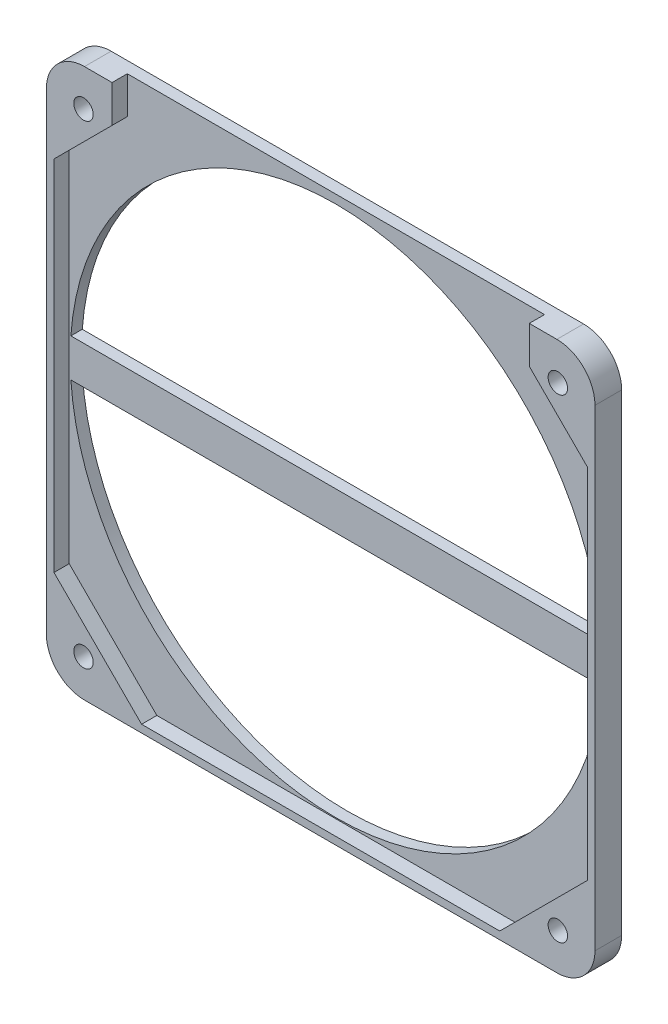
ISO-10303-21;
HEADER;
FILE_DESCRIPTION(('STEP AP214'),'2;1');
FILE_NAME('part.step','',(''),(''),'','','');
FILE_SCHEMA(('AUTOMOTIVE_DESIGN { 1 0 10303 214 1 1 1 1 }'));
ENDSEC;
DATA;
#1=APPLICATION_CONTEXT('core data for automotive mechanical design processes');
#2=APPLICATION_PROTOCOL_DEFINITION('international standard','automotive_design',2000,#1);
#3=PRODUCT_CONTEXT('',#1,'mechanical');
#4=PRODUCT('Part','Part','',(#3));
#5=PRODUCT_RELATED_PRODUCT_CATEGORY('part','',(#4));
#6=PRODUCT_DEFINITION_FORMATION('','',#4);
#7=PRODUCT_DEFINITION_CONTEXT('part definition',#1,'design');
#8=PRODUCT_DEFINITION('design','',#6,#7);
#9=PRODUCT_DEFINITION_SHAPE('','',#8);
#10=(LENGTH_UNIT() NAMED_UNIT(*) SI_UNIT(.MILLI.,.METRE.));
#11=(NAMED_UNIT(*) PLANE_ANGLE_UNIT() SI_UNIT($,.RADIAN.));
#12=(NAMED_UNIT(*) SI_UNIT($,.STERADIAN.) SOLID_ANGLE_UNIT());
#13=UNCERTAINTY_MEASURE_WITH_UNIT(LENGTH_MEASURE(1.E-05),#10,'distance_accuracy_value','');
#14=(GEOMETRIC_REPRESENTATION_CONTEXT(3) GLOBAL_UNCERTAINTY_ASSIGNED_CONTEXT((#13)) GLOBAL_UNIT_ASSIGNED_CONTEXT((#10,
#11,#12)) REPRESENTATION_CONTEXT('',''));
#15=CARTESIAN_POINT('',(0.,0.,0.));
#16=DIRECTION('',(0.,0.,1.));
#17=DIRECTION('',(1.,0.,0.));
#18=AXIS2_PLACEMENT_3D('',#15,#16,#17);
#19=CARTESIAN_POINT('',(0.,0.,0.));
#20=DIRECTION('',(0.,0.,1.));
#21=DIRECTION('',(1.,0.,0.));
#22=AXIS2_PLACEMENT_3D('',#19,#20,#21);
#23=PLANE('',#22);
#24=DIRECTION('',(1.,0.,0.));
#25=VECTOR('',#24,1.);
#26=CARTESIAN_POINT('',(-72.,-72.,0.));
#27=LINE('',#26,#25);
#28=CARTESIAN_POINT('',(-62.,-72.,0.));
#29=VERTEX_POINT('',#28);
#30=CARTESIAN_POINT('',(62.,-72.,0.));
#31=VERTEX_POINT('',#30);
#32=EDGE_CURVE('E326',#29,#31,#27,.T.);
#33=ORIENTED_EDGE('',*,*,#32,.F.);
#34=CARTESIAN_POINT('',(-62.,-62.,0.));
#35=DIRECTION('',(0.,0.,1.));
#36=DIRECTION('',(1.,0.,0.));
#37=AXIS2_PLACEMENT_3D('',#34,#35,#36);
#38=CIRCLE('',#37,10.);
#39=CARTESIAN_POINT('',(-72.,-62.,0.));
#40=VERTEX_POINT('',#39);
#41=EDGE_CURVE('E355',#29,#40,#38,.F.);
#42=ORIENTED_EDGE('',*,*,#41,.T.);
#43=DIRECTION('',(0.,-1.,0.));
#44=VECTOR('',#43,1.);
#45=CARTESIAN_POINT('',(-72.,72.,0.));
#46=LINE('',#45,#44);
#47=CARTESIAN_POINT('',(-72.,62.,0.));
#48=VERTEX_POINT('',#47);
#49=EDGE_CURVE('E340',#48,#40,#46,.T.);
#50=ORIENTED_EDGE('',*,*,#49,.F.);
#51=CARTESIAN_POINT('',(-62.,62.,0.));
#52=DIRECTION('',(0.,0.,1.));
#53=DIRECTION('',(1.,0.,0.));
#54=AXIS2_PLACEMENT_3D('',#51,#52,#53);
#55=CIRCLE('',#54,10.);
#56=CARTESIAN_POINT('',(-62.,72.,0.));
#57=VERTEX_POINT('',#56);
#58=EDGE_CURVE('E349',#48,#57,#55,.F.);
#59=ORIENTED_EDGE('',*,*,#58,.T.);
#60=DIRECTION('',(-1.,0.,0.));
#61=VECTOR('',#60,1.);
#62=CARTESIAN_POINT('',(-72.,72.,0.));
#63=LINE('',#62,#61);
#64=CARTESIAN_POINT('',(62.,72.,0.));
#65=VERTEX_POINT('',#64);
#66=EDGE_CURVE('E337',#65,#57,#63,.T.);
#67=ORIENTED_EDGE('',*,*,#66,.F.);
#68=CARTESIAN_POINT('',(62.,62.,0.));
#69=DIRECTION('',(0.,0.,1.));
#70=DIRECTION('',(1.,0.,0.));
#71=AXIS2_PLACEMENT_3D('',#68,#69,#70);
#72=CIRCLE('',#71,10.);
#73=CARTESIAN_POINT('',(72.,62.,0.));
#74=VERTEX_POINT('',#73);
#75=EDGE_CURVE('E351',#65,#74,#72,.F.);
#76=ORIENTED_EDGE('',*,*,#75,.T.);
#77=DIRECTION('',(0.,1.,0.));
#78=VECTOR('',#77,1.);
#79=CARTESIAN_POINT('',(72.,72.,0.));
#80=LINE('',#79,#78);
#81=CARTESIAN_POINT('',(72.,-62.,0.));
#82=VERTEX_POINT('',#81);
#83=EDGE_CURVE('E322',#82,#74,#80,.T.);
#84=ORIENTED_EDGE('',*,*,#83,.F.);
#85=CARTESIAN_POINT('',(62.,-62.,0.));
#86=DIRECTION('',(0.,0.,1.));
#87=DIRECTION('',(1.,0.,0.));
#88=AXIS2_PLACEMENT_3D('',#85,#86,#87);
#89=CIRCLE('',#88,10.);
#90=EDGE_CURVE('E353',#82,#31,#89,.F.);
#91=ORIENTED_EDGE('',*,*,#90,.T.);
#92=EDGE_LOOP('',(#33,#42,#50,#59,#67,#76,#84,#91));
#93=FACE_BOUND('',#92,.T.);
#94=CARTESIAN_POINT('',(0.,0.,0.));
#95=DIRECTION('',(0.,0.,1.));
#96=DIRECTION('',(1.,0.,0.));
#97=AXIS2_PLACEMENT_3D('',#94,#95,#96);
#98=CIRCLE('',#97,69.75);
#99=CARTESIAN_POINT('',(69.5705577094219,5.,0.));
#100=VERTEX_POINT('',#99);
#101=CARTESIAN_POINT('',(-69.5705577094219,5.,0.));
#102=VERTEX_POINT('',#101);
#103=EDGE_CURVE('E211',#100,#102,#98,.T.);
#104=ORIENTED_EDGE('',*,*,#103,.T.);
#105=DIRECTION('',(1.,0.,0.));
#106=VECTOR('',#105,1.);
#107=CARTESIAN_POINT('',(0.,5.,0.));
#108=LINE('',#107,#106);
#109=EDGE_CURVE('E208',#102,#100,#108,.T.);
#110=ORIENTED_EDGE('',*,*,#109,.T.);
#111=EDGE_LOOP('',(#104,#110));
#112=FACE_BOUND('',#111,.T.);
#113=DIRECTION('',(1.,0.,0.));
#114=VECTOR('',#113,1.);
#115=CARTESIAN_POINT('',(0.,-5.,0.));
#116=LINE('',#115,#114);
#117=CARTESIAN_POINT('',(-69.5705577094219,-5.,0.));
#118=VERTEX_POINT('',#117);
#119=CARTESIAN_POINT('',(69.5705577094219,-5.,0.));
#120=VERTEX_POINT('',#119);
#121=EDGE_CURVE('E188',#118,#120,#116,.T.);
#122=ORIENTED_EDGE('',*,*,#121,.F.);
#123=CARTESIAN_POINT('',(0.,0.,0.));
#124=DIRECTION('',(0.,0.,1.));
#125=DIRECTION('',(1.,0.,0.));
#126=AXIS2_PLACEMENT_3D('',#123,#124,#125);
#127=CIRCLE('',#126,69.75);
#128=EDGE_CURVE('E196',#118,#120,#127,.T.);
#129=ORIENTED_EDGE('',*,*,#128,.T.);
#130=EDGE_LOOP('',(#122,#129));
#131=FACE_BOUND('',#130,.T.);
#132=ADVANCED_FACE('F33',(#93,#112,#131),#23,.F.);
#133=CARTESIAN_POINT('',(0.,0.,3.));
#134=DIRECTION('',(0.,0.,1.));
#135=DIRECTION('',(1.,0.,0.));
#136=AXIS2_PLACEMENT_3D('',#133,#134,#135);
#137=PLANE('',#136);
#138=DIRECTION('',(1.,0.,0.));
#139=VECTOR('',#138,1.);
#140=CARTESIAN_POINT('',(0.,5.,3.));
#141=LINE('',#140,#139);
#142=CARTESIAN_POINT('',(-69.5705577094219,5.,3.));
#143=VERTEX_POINT('',#142);
#144=CARTESIAN_POINT('',(69.5705577094219,5.,3.));
#145=VERTEX_POINT('',#144);
#146=EDGE_CURVE('E206',#143,#145,#141,.T.);
#147=ORIENTED_EDGE('',*,*,#146,.F.);
#148=CARTESIAN_POINT('',(0.,0.,3.));
#149=DIRECTION('',(0.,0.,1.));
#150=DIRECTION('',(1.,0.,0.));
#151=AXIS2_PLACEMENT_3D('',#148,#149,#150);
#152=CIRCLE('',#151,69.75);
#153=EDGE_CURVE('E212',#145,#143,#152,.T.);
#154=ORIENTED_EDGE('',*,*,#153,.F.);
#155=EDGE_LOOP('',(#147,#154));
#156=FACE_BOUND('',#155,.T.);
#157=DIRECTION('',(0.707106781186543,-0.707106781186552,0.));
#158=VECTOR('',#157,1.);
#159=CARTESIAN_POINT('',(58.5000000000004,58.4999999999996,3.));
#160=LINE('',#159,#158);
#161=CARTESIAN_POINT('',(54.7523340597113,62.2476659402887,3.));
#162=VERTEX_POINT('',#161);
#163=CARTESIAN_POINT('',(70.,46.9999999999998,3.));
#164=VERTEX_POINT('',#163);
#165=EDGE_CURVE('E224',#162,#164,#160,.T.);
#166=ORIENTED_EDGE('',*,*,#165,.F.);
#167=DIRECTION('',(0.,1.,0.));
#168=VECTOR('',#167,1.);
#169=CARTESIAN_POINT('',(54.7523340597113,0.,3.));
#170=LINE('',#169,#168);
#171=CARTESIAN_POINT('',(54.7523340597113,72.,3.));
#172=VERTEX_POINT('',#171);
#173=EDGE_CURVE('E227',#162,#172,#170,.T.);
#174=ORIENTED_EDGE('',*,*,#173,.T.);
#175=DIRECTION('',(-1.,0.,0.));
#176=VECTOR('',#175,1.);
#177=CARTESIAN_POINT('',(0.,72.,3.));
#178=LINE('',#177,#176);
#179=CARTESIAN_POINT('',(-54.7523340597113,72.,3.));
#180=VERTEX_POINT('',#179);
#181=EDGE_CURVE('E231',#172,#180,#178,.T.);
#182=ORIENTED_EDGE('',*,*,#181,.T.);
#183=DIRECTION('',(0.,1.,0.));
#184=VECTOR('',#183,1.);
#185=CARTESIAN_POINT('',(-54.7523340597113,0.,3.));
#186=LINE('',#185,#184);
#187=CARTESIAN_POINT('',(-54.7523340597113,62.2476659402887,3.));
#188=VERTEX_POINT('',#187);
#189=EDGE_CURVE('E234',#188,#180,#186,.T.);
#190=ORIENTED_EDGE('',*,*,#189,.F.);
#191=DIRECTION('',(0.70710678118655,0.707106781186545,0.));
#192=VECTOR('',#191,1.);
#193=CARTESIAN_POINT('',(-58.4999999999998,58.5000000000002,3.));
#194=LINE('',#193,#192);
#195=CARTESIAN_POINT('',(-70.,47.0000000000001,3.));
#196=VERTEX_POINT('',#195);
#197=EDGE_CURVE('E236',#196,#188,#194,.T.);
#198=ORIENTED_EDGE('',*,*,#197,.F.);
#199=DIRECTION('',(0.,-1.,0.));
#200=VECTOR('',#199,1.);
#201=CARTESIAN_POINT('',(-70.,0.,3.));
#202=LINE('',#201,#200);
#203=CARTESIAN_POINT('',(-70.,-47.,3.));
#204=VERTEX_POINT('',#203);
#205=EDGE_CURVE('E238',#196,#204,#202,.T.);
#206=ORIENTED_EDGE('',*,*,#205,.T.);
#207=DIRECTION('',(-0.707106781186548,0.707106781186548,0.));
#208=VECTOR('',#207,1.);
#209=CARTESIAN_POINT('',(-58.5,-58.5,3.));
#210=LINE('',#209,#208);
#211=CARTESIAN_POINT('',(-47.,-70.,3.));
#212=VERTEX_POINT('',#211);
#213=EDGE_CURVE('E241',#212,#204,#210,.T.);
#214=ORIENTED_EDGE('',*,*,#213,.F.);
#215=DIRECTION('',(1.,0.,0.));
#216=VECTOR('',#215,1.);
#217=CARTESIAN_POINT('',(0.,-70.,3.));
#218=LINE('',#217,#216);
#219=CARTESIAN_POINT('',(46.9999999999997,-70.,3.));
#220=VERTEX_POINT('',#219);
#221=EDGE_CURVE('E243',#212,#220,#218,.T.);
#222=ORIENTED_EDGE('',*,*,#221,.T.);
#223=DIRECTION('',(-0.707106781186555,-0.70710678118654,0.));
#224=VECTOR('',#223,1.);
#225=CARTESIAN_POINT('',(58.4999999999994,-58.5000000000006,3.));
#226=LINE('',#225,#224);
#227=CARTESIAN_POINT('',(70.,-47.0000000000002,3.));
#228=VERTEX_POINT('',#227);
#229=EDGE_CURVE('E246',#228,#220,#226,.T.);
#230=ORIENTED_EDGE('',*,*,#229,.F.);
#231=DIRECTION('',(0.,-1.,0.));
#232=VECTOR('',#231,1.);
#233=CARTESIAN_POINT('',(70.,0.,3.));
#234=LINE('',#233,#232);
#235=EDGE_CURVE('E248',#164,#228,#234,.T.);
#236=ORIENTED_EDGE('',*,*,#235,.F.);
#237=EDGE_LOOP('',(#166,#174,#182,#190,#198,#206,#214,#222,#230,#236));
#238=FACE_BOUND('',#237,.T.);
#239=CARTESIAN_POINT('',(0.,0.,3.));
#240=DIRECTION('',(0.,0.,1.));
#241=DIRECTION('',(1.,0.,0.));
#242=AXIS2_PLACEMENT_3D('',#239,#240,#241);
#243=CIRCLE('',#242,69.75);
#244=CARTESIAN_POINT('',(-69.5705577094219,-5.,3.));
#245=VERTEX_POINT('',#244);
#246=CARTESIAN_POINT('',(69.5705577094219,-5.,3.));
#247=VERTEX_POINT('',#246);
#248=EDGE_CURVE('E201',#245,#247,#243,.T.);
#249=ORIENTED_EDGE('',*,*,#248,.F.);
#250=DIRECTION('',(1.,0.,0.));
#251=VECTOR('',#250,1.);
#252=CARTESIAN_POINT('',(0.,-5.,3.));
#253=LINE('',#252,#251);
#254=EDGE_CURVE('E191',#245,#247,#253,.T.);
#255=ORIENTED_EDGE('',*,*,#254,.T.);
#256=EDGE_LOOP('',(#249,#255));
#257=FACE_BOUND('',#256,.T.);
#258=ADVANCED_FACE('F419',(#156,#238,#257),#137,.T.);
#259=CARTESIAN_POINT('',(-72.,72.,7.));
#260=DIRECTION('',(0.,-1.,0.));
#261=DIRECTION('',(0.,0.,-1.));
#262=AXIS2_PLACEMENT_3D('',#259,#260,#261);
#263=PLANE('',#262);
#264=DIRECTION('',(-1.,0.,0.));
#265=VECTOR('',#264,1.);
#266=CARTESIAN_POINT('',(-72.,72.,7.));
#267=LINE('',#266,#265);
#268=CARTESIAN_POINT('',(62.,72.,7.));
#269=VERTEX_POINT('',#268);
#270=CARTESIAN_POINT('',(54.7523340597113,72.,7.));
#271=VERTEX_POINT('',#270);
#272=EDGE_CURVE('E327',#269,#271,#267,.T.);
#273=ORIENTED_EDGE('',*,*,#272,.F.);
#274=DIRECTION('',(0.,0.,-1.));
#275=VECTOR('',#274,1.);
#276=CARTESIAN_POINT('',(62.,72.,7.));
#277=LINE('',#276,#275);
#278=EDGE_CURVE('E11',#269,#65,#277,.T.);
#279=ORIENTED_EDGE('',*,*,#278,.T.);
#280=ORIENTED_EDGE('',*,*,#66,.T.);
#281=DIRECTION('',(0.,0.,-1.));
#282=VECTOR('',#281,1.);
#283=CARTESIAN_POINT('',(-62.,72.,7.));
#284=LINE('',#283,#282);
#285=CARTESIAN_POINT('',(-62.,72.,7.));
#286=VERTEX_POINT('',#285);
#287=EDGE_CURVE('E41',#57,#286,#284,.F.);
#288=ORIENTED_EDGE('',*,*,#287,.T.);
#289=CARTESIAN_POINT('',(-54.7523340597113,72.,7.));
#290=VERTEX_POINT('',#289);
#291=EDGE_CURVE('E325',#290,#286,#267,.T.);
#292=ORIENTED_EDGE('',*,*,#291,.F.);
#293=DIRECTION('',(0.,0.,1.));
#294=VECTOR('',#293,1.);
#295=CARTESIAN_POINT('',(-54.7523340597113,72.,3.));
#296=LINE('',#295,#294);
#297=EDGE_CURVE('E292',#180,#290,#296,.T.);
#298=ORIENTED_EDGE('',*,*,#297,.F.);
#299=ORIENTED_EDGE('',*,*,#181,.F.);
#300=DIRECTION('',(0.,0.,1.));
#301=VECTOR('',#300,1.);
#302=CARTESIAN_POINT('',(54.7523340597113,72.,3.));
#303=LINE('',#302,#301);
#304=EDGE_CURVE('E294',#172,#271,#303,.T.);
#305=ORIENTED_EDGE('',*,*,#304,.T.);
#306=EDGE_LOOP('',(#273,#279,#280,#288,#292,#298,#299,#305));
#307=FACE_BOUND('',#306,.T.);
#308=ADVANCED_FACE('F376',(#307),#263,.F.);
#309=CARTESIAN_POINT('',(0.,0.,7.));
#310=DIRECTION('',(0.,0.,1.));
#311=DIRECTION('',(1.,0.,0.));
#312=AXIS2_PLACEMENT_3D('',#309,#310,#311);
#313=PLANE('',#312);
#314=CARTESIAN_POINT('',(-62.25,-62.25,7.));
#315=DIRECTION('',(0.,0.,1.));
#316=DIRECTION('',(1.,0.,0.));
#317=AXIS2_PLACEMENT_3D('',#314,#315,#316);
#318=CIRCLE('',#317,2.54999999999999);
#319=CARTESIAN_POINT('',(-59.7,-62.25,7.));
#320=VERTEX_POINT('',#319);
#321=EDGE_CURVE('E279',#320,#320,#318,.T.);
#322=ORIENTED_EDGE('',*,*,#321,.F.);
#323=EDGE_LOOP('',(#322));
#324=FACE_BOUND('',#323,.T.);
#325=CARTESIAN_POINT('',(-62.25,62.25,7.));
#326=DIRECTION('',(0.,0.,1.));
#327=DIRECTION('',(1.,0.,0.));
#328=AXIS2_PLACEMENT_3D('',#325,#326,#327);
#329=CIRCLE('',#328,2.54999999999999);
#330=CARTESIAN_POINT('',(-59.7,62.25,7.));
#331=VERTEX_POINT('',#330);
#332=EDGE_CURVE('E304',#331,#331,#329,.T.);
#333=ORIENTED_EDGE('',*,*,#332,.F.);
#334=EDGE_LOOP('',(#333));
#335=FACE_BOUND('',#334,.T.);
#336=CARTESIAN_POINT('',(62.25,62.25,7.));
#337=DIRECTION('',(0.,0.,1.));
#338=DIRECTION('',(1.,0.,0.));
#339=AXIS2_PLACEMENT_3D('',#336,#337,#338);
#340=CIRCLE('',#339,2.54999999999999);
#341=CARTESIAN_POINT('',(64.8,62.25,7.));
#342=VERTEX_POINT('',#341);
#343=EDGE_CURVE('E310',#342,#342,#340,.T.);
#344=ORIENTED_EDGE('',*,*,#343,.F.);
#345=EDGE_LOOP('',(#344));
#346=FACE_BOUND('',#345,.T.);
#347=CARTESIAN_POINT('',(62.25,-62.25,7.));
#348=DIRECTION('',(0.,0.,1.));
#349=DIRECTION('',(1.,0.,0.));
#350=AXIS2_PLACEMENT_3D('',#347,#348,#349);
#351=CIRCLE('',#350,2.54999999999999);
#352=CARTESIAN_POINT('',(64.8,-62.25,7.));
#353=VERTEX_POINT('',#352);
#354=EDGE_CURVE('E316',#353,#353,#351,.T.);
#355=ORIENTED_EDGE('',*,*,#354,.F.);
#356=EDGE_LOOP('',(#355));
#357=FACE_BOUND('',#356,.T.);
#358=DIRECTION('',(0.,-1.,0.));
#359=VECTOR('',#358,1.);
#360=CARTESIAN_POINT('',(-72.,72.,7.));
#361=LINE('',#360,#359);
#362=CARTESIAN_POINT('',(-72.,62.,7.));
#363=VERTEX_POINT('',#362);
#364=CARTESIAN_POINT('',(-72.,-62.,7.));
#365=VERTEX_POINT('',#364);
#366=EDGE_CURVE('E329',#363,#365,#361,.T.);
#367=ORIENTED_EDGE('',*,*,#366,.T.);
#368=CARTESIAN_POINT('',(-62.,-62.,7.));
#369=DIRECTION('',(0.,0.,1.));
#370=DIRECTION('',(1.,0.,0.));
#371=AXIS2_PLACEMENT_3D('',#368,#369,#370);
#372=CIRCLE('',#371,10.);
#373=CARTESIAN_POINT('',(-62.,-72.,7.));
#374=VERTEX_POINT('',#373);
#375=EDGE_CURVE('E367',#365,#374,#372,.T.);
#376=ORIENTED_EDGE('',*,*,#375,.T.);
#377=DIRECTION('',(1.,0.,0.));
#378=VECTOR('',#377,1.);
#379=CARTESIAN_POINT('',(-72.,-72.,7.));
#380=LINE('',#379,#378);
#381=CARTESIAN_POINT('',(62.,-72.,7.));
#382=VERTEX_POINT('',#381);
#383=EDGE_CURVE('E332',#374,#382,#380,.T.);
#384=ORIENTED_EDGE('',*,*,#383,.T.);
#385=CARTESIAN_POINT('',(62.,-62.,7.));
#386=DIRECTION('',(0.,0.,1.));
#387=DIRECTION('',(1.,0.,0.));
#388=AXIS2_PLACEMENT_3D('',#385,#386,#387);
#389=CIRCLE('',#388,10.);
#390=CARTESIAN_POINT('',(72.,-62.,7.));
#391=VERTEX_POINT('',#390);
#392=EDGE_CURVE('E365',#382,#391,#389,.T.);
#393=ORIENTED_EDGE('',*,*,#392,.T.);
#394=DIRECTION('',(0.,1.,0.));
#395=VECTOR('',#394,1.);
#396=CARTESIAN_POINT('',(72.,72.,7.));
#397=LINE('',#396,#395);
#398=CARTESIAN_POINT('',(72.,62.,7.));
#399=VERTEX_POINT('',#398);
#400=EDGE_CURVE('E323',#391,#399,#397,.T.);
#401=ORIENTED_EDGE('',*,*,#400,.T.);
#402=CARTESIAN_POINT('',(62.,62.,7.));
#403=DIRECTION('',(0.,0.,1.));
#404=DIRECTION('',(1.,0.,0.));
#405=AXIS2_PLACEMENT_3D('',#402,#403,#404);
#406=CIRCLE('',#405,10.);
#407=EDGE_CURVE('E48',#399,#269,#406,.T.);
#408=ORIENTED_EDGE('',*,*,#407,.T.);
#409=ORIENTED_EDGE('',*,*,#272,.T.);
#410=DIRECTION('',(0.,1.,0.));
#411=VECTOR('',#410,1.);
#412=CARTESIAN_POINT('',(54.7523340597113,0.,7.));
#413=LINE('',#412,#411);
#414=CARTESIAN_POINT('',(54.7523340597113,62.2476659402887,7.));
#415=VERTEX_POINT('',#414);
#416=EDGE_CURVE('E253',#415,#271,#413,.T.);
#417=ORIENTED_EDGE('',*,*,#416,.F.);
#418=DIRECTION('',(0.707106781186543,-0.707106781186552,0.));
#419=VECTOR('',#418,1.);
#420=CARTESIAN_POINT('',(58.5000000000004,58.4999999999996,7.));
#421=LINE('',#420,#419);
#422=CARTESIAN_POINT('',(70.,46.9999999999998,7.));
#423=VERTEX_POINT('',#422);
#424=EDGE_CURVE('E221',#415,#423,#421,.T.);
#425=ORIENTED_EDGE('',*,*,#424,.T.);
#426=DIRECTION('',(0.,-1.,0.));
#427=VECTOR('',#426,1.);
#428=CARTESIAN_POINT('',(70.,0.,7.));
#429=LINE('',#428,#427);
#430=CARTESIAN_POINT('',(70.,-47.0000000000002,7.));
#431=VERTEX_POINT('',#430);
#432=EDGE_CURVE('E228',#423,#431,#429,.T.);
#433=ORIENTED_EDGE('',*,*,#432,.T.);
#434=DIRECTION('',(-0.707106781186555,-0.70710678118654,0.));
#435=VECTOR('',#434,1.);
#436=CARTESIAN_POINT('',(58.4999999999994,-58.5000000000006,7.));
#437=LINE('',#436,#435);
#438=CARTESIAN_POINT('',(46.9999999999997,-70.,7.));
#439=VERTEX_POINT('',#438);
#440=EDGE_CURVE('E271',#431,#439,#437,.T.);
#441=ORIENTED_EDGE('',*,*,#440,.T.);
#442=DIRECTION('',(1.,0.,0.));
#443=VECTOR('',#442,1.);
#444=CARTESIAN_POINT('',(0.,-70.,7.));
#445=LINE('',#444,#443);
#446=CARTESIAN_POINT('',(-47.,-70.,7.));
#447=VERTEX_POINT('',#446);
#448=EDGE_CURVE('E268',#447,#439,#445,.T.);
#449=ORIENTED_EDGE('',*,*,#448,.F.);
#450=DIRECTION('',(-0.707106781186548,0.707106781186548,0.));
#451=VECTOR('',#450,1.);
#452=CARTESIAN_POINT('',(-58.5,-58.5,7.));
#453=LINE('',#452,#451);
#454=CARTESIAN_POINT('',(-70.,-47.,7.));
#455=VERTEX_POINT('',#454);
#456=EDGE_CURVE('E265',#447,#455,#453,.T.);
#457=ORIENTED_EDGE('',*,*,#456,.T.);
#458=DIRECTION('',(0.,-1.,0.));
#459=VECTOR('',#458,1.);
#460=CARTESIAN_POINT('',(-70.,0.,7.));
#461=LINE('',#460,#459);
#462=CARTESIAN_POINT('',(-70.,47.0000000000001,7.));
#463=VERTEX_POINT('',#462);
#464=EDGE_CURVE('E262',#463,#455,#461,.T.);
#465=ORIENTED_EDGE('',*,*,#464,.F.);
#466=DIRECTION('',(0.70710678118655,0.707106781186545,0.));
#467=VECTOR('',#466,1.);
#468=CARTESIAN_POINT('',(-58.4999999999998,58.5000000000002,7.));
#469=LINE('',#468,#467);
#470=CARTESIAN_POINT('',(-54.7523340597113,62.2476659402887,7.));
#471=VERTEX_POINT('',#470);
#472=EDGE_CURVE('E259',#463,#471,#469,.T.);
#473=ORIENTED_EDGE('',*,*,#472,.T.);
#474=DIRECTION('',(0.,1.,0.));
#475=VECTOR('',#474,1.);
#476=CARTESIAN_POINT('',(-54.7523340597113,0.,7.));
#477=LINE('',#476,#475);
#478=EDGE_CURVE('E256',#471,#290,#477,.T.);
#479=ORIENTED_EDGE('',*,*,#478,.T.);
#480=ORIENTED_EDGE('',*,*,#291,.T.);
#481=CARTESIAN_POINT('',(-62.,62.,7.));
#482=DIRECTION('',(0.,0.,1.));
#483=DIRECTION('',(1.,0.,0.));
#484=AXIS2_PLACEMENT_3D('',#481,#482,#483);
#485=CIRCLE('',#484,10.);
#486=EDGE_CURVE('E362',#286,#363,#485,.T.);
#487=ORIENTED_EDGE('',*,*,#486,.T.);
#488=EDGE_LOOP('',(#367,#376,#384,#393,#401,#408,#409,#417,#425,#433,#441,#449,#457,#465,#473,
#479,#480,#487));
#489=FACE_BOUND('',#488,.T.);
#490=ADVANCED_FACE('F381',(#324,#335,#346,#357,#489),#313,.T.);
#491=CARTESIAN_POINT('',(72.,72.,7.));
#492=DIRECTION('',(-1.,0.,0.));
#493=DIRECTION('',(0.,-1.,0.));
#494=AXIS2_PLACEMENT_3D('',#491,#492,#493);
#495=PLANE('',#494);
#496=ORIENTED_EDGE('',*,*,#400,.F.);
#497=DIRECTION('',(0.,0.,-1.));
#498=VECTOR('',#497,1.);
#499=CARTESIAN_POINT('',(72.,-62.,7.));
#500=LINE('',#499,#498);
#501=EDGE_CURVE('E370',#391,#82,#500,.T.);
#502=ORIENTED_EDGE('',*,*,#501,.T.);
#503=ORIENTED_EDGE('',*,*,#83,.T.);
#504=DIRECTION('',(0.,0.,-1.));
#505=VECTOR('',#504,1.);
#506=CARTESIAN_POINT('',(72.,62.,7.));
#507=LINE('',#506,#505);
#508=EDGE_CURVE('E56',#74,#399,#507,.F.);
#509=ORIENTED_EDGE('',*,*,#508,.T.);
#510=EDGE_LOOP('',(#496,#502,#503,#509));
#511=FACE_BOUND('',#510,.T.);
#512=ADVANCED_FACE('F405',(#511),#495,.F.);
#513=CARTESIAN_POINT('',(-72.,72.,7.));
#514=DIRECTION('',(1.,0.,0.));
#515=DIRECTION('',(0.,1.,0.));
#516=AXIS2_PLACEMENT_3D('',#513,#514,#515);
#517=PLANE('',#516);
#518=ORIENTED_EDGE('',*,*,#49,.T.);
#519=DIRECTION('',(0.,0.,-1.));
#520=VECTOR('',#519,1.);
#521=CARTESIAN_POINT('',(-72.,-62.,7.));
#522=LINE('',#521,#520);
#523=EDGE_CURVE('E360',#40,#365,#522,.F.);
#524=ORIENTED_EDGE('',*,*,#523,.T.);
#525=ORIENTED_EDGE('',*,*,#366,.F.);
#526=DIRECTION('',(0.,0.,-1.));
#527=VECTOR('',#526,1.);
#528=CARTESIAN_POINT('',(-72.,62.,7.));
#529=LINE('',#528,#527);
#530=EDGE_CURVE('E357',#363,#48,#529,.T.);
#531=ORIENTED_EDGE('',*,*,#530,.T.);
#532=EDGE_LOOP('',(#518,#524,#525,#531));
#533=FACE_BOUND('',#532,.T.);
#534=ADVANCED_FACE('F387',(#533),#517,.F.);
#535=CARTESIAN_POINT('',(-72.,-72.,7.));
#536=DIRECTION('',(0.,1.,0.));
#537=DIRECTION('',(0.,0.,1.));
#538=AXIS2_PLACEMENT_3D('',#535,#536,#537);
#539=PLANE('',#538);
#540=ORIENTED_EDGE('',*,*,#383,.F.);
#541=DIRECTION('',(0.,0.,-1.));
#542=VECTOR('',#541,1.);
#543=CARTESIAN_POINT('',(-62.,-72.,7.));
#544=LINE('',#543,#542);
#545=EDGE_CURVE('E346',#374,#29,#544,.T.);
#546=ORIENTED_EDGE('',*,*,#545,.T.);
#547=ORIENTED_EDGE('',*,*,#32,.T.);
#548=DIRECTION('',(0.,0.,-1.));
#549=VECTOR('',#548,1.);
#550=CARTESIAN_POINT('',(62.,-72.,7.));
#551=LINE('',#550,#549);
#552=EDGE_CURVE('E335',#31,#382,#551,.F.);
#553=ORIENTED_EDGE('',*,*,#552,.T.);
#554=EDGE_LOOP('',(#540,#546,#547,#553));
#555=FACE_BOUND('',#554,.T.);
#556=ADVANCED_FACE('F398',(#555),#539,.F.);
#557=CARTESIAN_POINT('',(62.25,-62.25,1.));
#558=DIRECTION('',(0.,0.,-1.));
#559=DIRECTION('',(-1.,0.,0.));
#560=AXIS2_PLACEMENT_3D('',#557,#558,#559);
#561=PLANE('',#560);
#562=CARTESIAN_POINT('',(62.25,-62.25,1.));
#563=DIRECTION('',(0.,0.,1.));
#564=DIRECTION('',(1.,0.,0.));
#565=AXIS2_PLACEMENT_3D('',#562,#563,#564);
#566=CIRCLE('',#565,2.55);
#567=CARTESIAN_POINT('',(64.8,-62.25,1.));
#568=VERTEX_POINT('',#567);
#569=EDGE_CURVE('E319',#568,#568,#566,.T.);
#570=ORIENTED_EDGE('',*,*,#569,.T.);
#571=EDGE_LOOP('',(#570));
#572=FACE_BOUND('',#571,.T.);
#573=ADVANCED_FACE('F473',(#572),#561,.F.);
#574=CARTESIAN_POINT('',(62.25,-62.25,7.));
#575=DIRECTION('',(0.,0.,1.));
#576=DIRECTION('',(1.,0.,0.));
#577=AXIS2_PLACEMENT_3D('',#574,#575,#576);
#578=CYLINDRICAL_SURFACE('',#577,2.55);
#579=ORIENTED_EDGE('',*,*,#569,.F.);
#580=EDGE_LOOP('',(#579));
#581=FACE_BOUND('',#580,.T.);
#582=ORIENTED_EDGE('',*,*,#354,.T.);
#583=EDGE_LOOP('',(#582));
#584=FACE_BOUND('',#583,.T.);
#585=ADVANCED_FACE('F699',(#581,#584),#578,.F.);
#586=CARTESIAN_POINT('',(62.25,62.25,1.));
#587=DIRECTION('',(0.,0.,-1.));
#588=DIRECTION('',(-1.,0.,0.));
#589=AXIS2_PLACEMENT_3D('',#586,#587,#588);
#590=PLANE('',#589);
#591=CARTESIAN_POINT('',(62.25,62.25,1.));
#592=DIRECTION('',(0.,0.,1.));
#593=DIRECTION('',(1.,0.,0.));
#594=AXIS2_PLACEMENT_3D('',#591,#592,#593);
#595=CIRCLE('',#594,2.55);
#596=CARTESIAN_POINT('',(64.8,62.25,1.));
#597=VERTEX_POINT('',#596);
#598=EDGE_CURVE('E313',#597,#597,#595,.T.);
#599=ORIENTED_EDGE('',*,*,#598,.T.);
#600=EDGE_LOOP('',(#599));
#601=FACE_BOUND('',#600,.T.);
#602=ADVANCED_FACE('F689',(#601),#590,.F.);
#603=CARTESIAN_POINT('',(62.25,62.25,7.));
#604=DIRECTION('',(0.,0.,1.));
#605=DIRECTION('',(1.,0.,0.));
#606=AXIS2_PLACEMENT_3D('',#603,#604,#605);
#607=CYLINDRICAL_SURFACE('',#606,2.55);
#608=ORIENTED_EDGE('',*,*,#598,.F.);
#609=EDGE_LOOP('',(#608));
#610=FACE_BOUND('',#609,.T.);
#611=ORIENTED_EDGE('',*,*,#343,.T.);
#612=EDGE_LOOP('',(#611));
#613=FACE_BOUND('',#612,.T.);
#614=ADVANCED_FACE('F679',(#610,#613),#607,.F.);
#615=CARTESIAN_POINT('',(-62.25,62.25,1.));
#616=DIRECTION('',(0.,0.,-1.));
#617=DIRECTION('',(-1.,0.,0.));
#618=AXIS2_PLACEMENT_3D('',#615,#616,#617);
#619=PLANE('',#618);
#620=CARTESIAN_POINT('',(-62.25,62.25,1.));
#621=DIRECTION('',(0.,0.,1.));
#622=DIRECTION('',(1.,0.,0.));
#623=AXIS2_PLACEMENT_3D('',#620,#621,#622);
#624=CIRCLE('',#623,2.55);
#625=CARTESIAN_POINT('',(-59.7,62.25,1.));
#626=VERTEX_POINT('',#625);
#627=EDGE_CURVE('E307',#626,#626,#624,.T.);
#628=ORIENTED_EDGE('',*,*,#627,.T.);
#629=EDGE_LOOP('',(#628));
#630=FACE_BOUND('',#629,.T.);
#631=ADVANCED_FACE('F669',(#630),#619,.F.);
#632=CARTESIAN_POINT('',(-62.25,62.25,7.));
#633=DIRECTION('',(0.,0.,1.));
#634=DIRECTION('',(1.,0.,0.));
#635=AXIS2_PLACEMENT_3D('',#632,#633,#634);
#636=CYLINDRICAL_SURFACE('',#635,2.54999999999999);
#637=ORIENTED_EDGE('',*,*,#627,.F.);
#638=EDGE_LOOP('',(#637));
#639=FACE_BOUND('',#638,.T.);
#640=ORIENTED_EDGE('',*,*,#332,.T.);
#641=EDGE_LOOP('',(#640));
#642=FACE_BOUND('',#641,.T.);
#643=ADVANCED_FACE('F659',(#639,#642),#636,.F.);
#644=CARTESIAN_POINT('',(-62.25,-62.25,1.));
#645=DIRECTION('',(0.,0.,-1.));
#646=DIRECTION('',(-1.,0.,0.));
#647=AXIS2_PLACEMENT_3D('',#644,#645,#646);
#648=PLANE('',#647);
#649=CARTESIAN_POINT('',(-62.25,-62.25,1.));
#650=DIRECTION('',(0.,0.,1.));
#651=DIRECTION('',(1.,0.,0.));
#652=AXIS2_PLACEMENT_3D('',#649,#650,#651);
#653=CIRCLE('',#652,2.55);
#654=CARTESIAN_POINT('',(-59.7,-62.25,1.));
#655=VERTEX_POINT('',#654);
#656=EDGE_CURVE('E301',#655,#655,#653,.T.);
#657=ORIENTED_EDGE('',*,*,#656,.T.);
#658=EDGE_LOOP('',(#657));
#659=FACE_BOUND('',#658,.T.);
#660=ADVANCED_FACE('F649',(#659),#648,.F.);
#661=CARTESIAN_POINT('',(-62.25,-62.25,7.));
#662=DIRECTION('',(0.,0.,1.));
#663=DIRECTION('',(1.,0.,0.));
#664=AXIS2_PLACEMENT_3D('',#661,#662,#663);
#665=CYLINDRICAL_SURFACE('',#664,2.54999999999999);
#666=ORIENTED_EDGE('',*,*,#656,.F.);
#667=EDGE_LOOP('',(#666));
#668=FACE_BOUND('',#667,.T.);
#669=ORIENTED_EDGE('',*,*,#321,.T.);
#670=EDGE_LOOP('',(#669));
#671=FACE_BOUND('',#670,.T.);
#672=ADVANCED_FACE('F640',(#668,#671),#665,.F.);
#673=CARTESIAN_POINT('',(58.5000000000004,58.4999999999996,3.));
#674=DIRECTION('',(-0.707106781186552,-0.707106781186543,0.));
#675=DIRECTION('',(0.707106781186543,-0.707106781186552,0.));
#676=AXIS2_PLACEMENT_3D('',#673,#674,#675);
#677=PLANE('',#676);
#678=ORIENTED_EDGE('',*,*,#424,.F.);
#679=DIRECTION('',(0.,0.,1.));
#680=VECTOR('',#679,1.);
#681=CARTESIAN_POINT('',(54.7523340597113,62.2476659402887,3.));
#682=LINE('',#681,#680);
#683=EDGE_CURVE('E250',#162,#415,#682,.T.);
#684=ORIENTED_EDGE('',*,*,#683,.F.);
#685=ORIENTED_EDGE('',*,*,#165,.T.);
#686=DIRECTION('',(0.,0.,1.));
#687=VECTOR('',#686,1.);
#688=CARTESIAN_POINT('',(70.,46.9999999999998,3.));
#689=LINE('',#688,#687);
#690=EDGE_CURVE('E276',#164,#423,#689,.T.);
#691=ORIENTED_EDGE('',*,*,#690,.T.);
#692=EDGE_LOOP('',(#678,#684,#685,#691));
#693=FACE_BOUND('',#692,.T.);
#694=ADVANCED_FACE('F416',(#693),#677,.T.);
#695=CARTESIAN_POINT('',(70.,0.,3.));
#696=DIRECTION('',(-1.,0.,0.));
#697=DIRECTION('',(0.,-1.,0.));
#698=AXIS2_PLACEMENT_3D('',#695,#696,#697);
#699=PLANE('',#698);
#700=ORIENTED_EDGE('',*,*,#432,.F.);
#701=ORIENTED_EDGE('',*,*,#690,.F.);
#702=ORIENTED_EDGE('',*,*,#235,.T.);
#703=DIRECTION('',(0.,0.,1.));
#704=VECTOR('',#703,1.);
#705=CARTESIAN_POINT('',(70.,-47.0000000000002,3.));
#706=LINE('',#705,#704);
#707=EDGE_CURVE('E280',#228,#431,#706,.T.);
#708=ORIENTED_EDGE('',*,*,#707,.T.);
#709=EDGE_LOOP('',(#700,#701,#702,#708));
#710=FACE_BOUND('',#709,.T.);
#711=ADVANCED_FACE('F424',(#710),#699,.T.);
#712=CARTESIAN_POINT('',(58.4999999999994,-58.5000000000006,3.));
#713=DIRECTION('',(-0.70710678118654,0.707106781186555,0.));
#714=DIRECTION('',(-0.707106781186555,-0.70710678118654,0.));
#715=AXIS2_PLACEMENT_3D('',#712,#713,#714);
#716=PLANE('',#715);
#717=ORIENTED_EDGE('',*,*,#440,.F.);
#718=ORIENTED_EDGE('',*,*,#707,.F.);
#719=ORIENTED_EDGE('',*,*,#229,.T.);
#720=DIRECTION('',(0.,0.,1.));
#721=VECTOR('',#720,1.);
#722=CARTESIAN_POINT('',(46.9999999999997,-70.,3.));
#723=LINE('',#722,#721);
#724=EDGE_CURVE('E282',#220,#439,#723,.T.);
#725=ORIENTED_EDGE('',*,*,#724,.T.);
#726=EDGE_LOOP('',(#717,#718,#719,#725));
#727=FACE_BOUND('',#726,.T.);
#728=ADVANCED_FACE('F427',(#727),#716,.T.);
#729=CARTESIAN_POINT('',(0.,-70.,3.));
#730=DIRECTION('',(0.,-1.,0.));
#731=DIRECTION('',(0.,0.,-1.));
#732=AXIS2_PLACEMENT_3D('',#729,#730,#731);
#733=PLANE('',#732);
#734=ORIENTED_EDGE('',*,*,#448,.T.);
#735=ORIENTED_EDGE('',*,*,#724,.F.);
#736=ORIENTED_EDGE('',*,*,#221,.F.);
#737=DIRECTION('',(0.,0.,1.));
#738=VECTOR('',#737,1.);
#739=CARTESIAN_POINT('',(-47.,-70.,3.));
#740=LINE('',#739,#738);
#741=EDGE_CURVE('E284',#212,#447,#740,.T.);
#742=ORIENTED_EDGE('',*,*,#741,.T.);
#743=EDGE_LOOP('',(#734,#735,#736,#742));
#744=FACE_BOUND('',#743,.T.);
#745=ADVANCED_FACE('F433',(#744),#733,.F.);
#746=CARTESIAN_POINT('',(-58.5,-58.5,3.));
#747=DIRECTION('',(0.707106781186547,0.707106781186547,0.));
#748=DIRECTION('',(-0.707106781186548,0.707106781186548,0.));
#749=AXIS2_PLACEMENT_3D('',#746,#747,#748);
#750=PLANE('',#749);
#751=ORIENTED_EDGE('',*,*,#456,.F.);
#752=ORIENTED_EDGE('',*,*,#741,.F.);
#753=ORIENTED_EDGE('',*,*,#213,.T.);
#754=DIRECTION('',(0.,0.,1.));
#755=VECTOR('',#754,1.);
#756=CARTESIAN_POINT('',(-70.,-47.,3.));
#757=LINE('',#756,#755);
#758=EDGE_CURVE('E286',#204,#455,#757,.T.);
#759=ORIENTED_EDGE('',*,*,#758,.T.);
#760=EDGE_LOOP('',(#751,#752,#753,#759));
#761=FACE_BOUND('',#760,.T.);
#762=ADVANCED_FACE('F437',(#761),#750,.T.);
#763=CARTESIAN_POINT('',(-70.,0.,3.));
#764=DIRECTION('',(-1.,0.,0.));
#765=DIRECTION('',(0.,-1.,0.));
#766=AXIS2_PLACEMENT_3D('',#763,#764,#765);
#767=PLANE('',#766);
#768=ORIENTED_EDGE('',*,*,#464,.T.);
#769=ORIENTED_EDGE('',*,*,#758,.F.);
#770=ORIENTED_EDGE('',*,*,#205,.F.);
#771=DIRECTION('',(0.,0.,1.));
#772=VECTOR('',#771,1.);
#773=CARTESIAN_POINT('',(-70.,47.0000000000001,3.));
#774=LINE('',#773,#772);
#775=EDGE_CURVE('E288',#196,#463,#774,.T.);
#776=ORIENTED_EDGE('',*,*,#775,.T.);
#777=EDGE_LOOP('',(#768,#769,#770,#776));
#778=FACE_BOUND('',#777,.T.);
#779=ADVANCED_FACE('F441',(#778),#767,.F.);
#780=CARTESIAN_POINT('',(-58.4999999999998,58.5000000000002,3.));
#781=DIRECTION('',(0.707106781186545,-0.70710678118655,0.));
#782=DIRECTION('',(0.70710678118655,0.707106781186545,0.));
#783=AXIS2_PLACEMENT_3D('',#780,#781,#782);
#784=PLANE('',#783);
#785=ORIENTED_EDGE('',*,*,#472,.F.);
#786=ORIENTED_EDGE('',*,*,#775,.F.);
#787=ORIENTED_EDGE('',*,*,#197,.T.);
#788=DIRECTION('',(0.,0.,1.));
#789=VECTOR('',#788,1.);
#790=CARTESIAN_POINT('',(-54.7523340597113,62.2476659402887,3.));
#791=LINE('',#790,#789);
#792=EDGE_CURVE('E290',#188,#471,#791,.T.);
#793=ORIENTED_EDGE('',*,*,#792,.T.);
#794=EDGE_LOOP('',(#785,#786,#787,#793));
#795=FACE_BOUND('',#794,.T.);
#796=ADVANCED_FACE('F444',(#795),#784,.T.);
#797=CARTESIAN_POINT('',(-54.7523340597113,0.,3.));
#798=DIRECTION('',(1.,0.,0.));
#799=DIRECTION('',(0.,0.,-1.));
#800=AXIS2_PLACEMENT_3D('',#797,#798,#799);
#801=PLANE('',#800);
#802=ORIENTED_EDGE('',*,*,#478,.F.);
#803=ORIENTED_EDGE('',*,*,#792,.F.);
#804=ORIENTED_EDGE('',*,*,#189,.T.);
#805=ORIENTED_EDGE('',*,*,#297,.T.);
#806=EDGE_LOOP('',(#802,#803,#804,#805));
#807=FACE_BOUND('',#806,.T.);
#808=ADVANCED_FACE('F449',(#807),#801,.T.);
#809=CARTESIAN_POINT('',(54.7523340597113,0.,3.));
#810=DIRECTION('',(1.,0.,0.));
#811=DIRECTION('',(0.,0.,-1.));
#812=AXIS2_PLACEMENT_3D('',#809,#810,#811);
#813=PLANE('',#812);
#814=ORIENTED_EDGE('',*,*,#416,.T.);
#815=ORIENTED_EDGE('',*,*,#304,.F.);
#816=ORIENTED_EDGE('',*,*,#173,.F.);
#817=ORIENTED_EDGE('',*,*,#683,.T.);
#818=EDGE_LOOP('',(#814,#815,#816,#817));
#819=FACE_BOUND('',#818,.T.);
#820=ADVANCED_FACE('F412',(#819),#813,.F.);
#821=CARTESIAN_POINT('',(0.,5.,0.));
#822=DIRECTION('',(0.,-1.,0.));
#823=DIRECTION('',(0.,0.,-1.));
#824=AXIS2_PLACEMENT_3D('',#821,#822,#823);
#825=PLANE('',#824);
#826=ORIENTED_EDGE('',*,*,#146,.T.);
#827=DIRECTION('',(0.,0.,1.));
#828=VECTOR('',#827,1.);
#829=CARTESIAN_POINT('',(69.5705577094219,5.,0.));
#830=LINE('',#829,#828);
#831=EDGE_CURVE('E215',#100,#145,#830,.T.);
#832=ORIENTED_EDGE('',*,*,#831,.F.);
#833=ORIENTED_EDGE('',*,*,#109,.F.);
#834=DIRECTION('',(0.,0.,1.));
#835=VECTOR('',#834,1.);
#836=CARTESIAN_POINT('',(-69.5705577094219,5.,0.));
#837=LINE('',#836,#835);
#838=EDGE_CURVE('E219',#102,#143,#837,.T.);
#839=ORIENTED_EDGE('',*,*,#838,.T.);
#840=EDGE_LOOP('',(#826,#832,#833,#839));
#841=FACE_BOUND('',#840,.T.);
#842=ADVANCED_FACE('F456',(#841),#825,.F.);
#843=CARTESIAN_POINT('',(0.,0.,0.));
#844=DIRECTION('',(0.,0.,1.));
#845=DIRECTION('',(1.,0.,0.));
#846=AXIS2_PLACEMENT_3D('',#843,#844,#845);
#847=CYLINDRICAL_SURFACE('',#846,69.75);
#848=ORIENTED_EDGE('',*,*,#153,.T.);
#849=ORIENTED_EDGE('',*,*,#838,.F.);
#850=ORIENTED_EDGE('',*,*,#103,.F.);
#851=ORIENTED_EDGE('',*,*,#831,.T.);
#852=EDGE_LOOP('',(#848,#849,#850,#851));
#853=FACE_BOUND('',#852,.T.);
#854=ADVANCED_FACE('F554',(#853),#847,.F.);
#855=CARTESIAN_POINT('',(0.,-5.,0.));
#856=DIRECTION('',(0.,-1.,0.));
#857=DIRECTION('',(0.,0.,-1.));
#858=AXIS2_PLACEMENT_3D('',#855,#856,#857);
#859=PLANE('',#858);
#860=ORIENTED_EDGE('',*,*,#254,.F.);
#861=DIRECTION('',(0.,0.,1.));
#862=VECTOR('',#861,1.);
#863=CARTESIAN_POINT('',(-69.5705577094219,-5.,0.));
#864=LINE('',#863,#862);
#865=EDGE_CURVE('E184',#118,#245,#864,.T.);
#866=ORIENTED_EDGE('',*,*,#865,.F.);
#867=ORIENTED_EDGE('',*,*,#121,.T.);
#868=DIRECTION('',(0.,0.,1.));
#869=VECTOR('',#868,1.);
#870=CARTESIAN_POINT('',(69.5705577094219,-5.,0.));
#871=LINE('',#870,#869);
#872=EDGE_CURVE('E195',#120,#247,#871,.T.);
#873=ORIENTED_EDGE('',*,*,#872,.T.);
#874=EDGE_LOOP('',(#860,#866,#867,#873));
#875=FACE_BOUND('',#874,.T.);
#876=ADVANCED_FACE('F186',(#875),#859,.T.);
#877=CARTESIAN_POINT('',(0.,0.,0.));
#878=DIRECTION('',(0.,0.,1.));
#879=DIRECTION('',(1.,0.,0.));
#880=AXIS2_PLACEMENT_3D('',#877,#878,#879);
#881=CYLINDRICAL_SURFACE('',#880,69.75);
#882=ORIENTED_EDGE('',*,*,#248,.T.);
#883=ORIENTED_EDGE('',*,*,#872,.F.);
#884=ORIENTED_EDGE('',*,*,#128,.F.);
#885=ORIENTED_EDGE('',*,*,#865,.T.);
#886=EDGE_LOOP('',(#882,#883,#884,#885));
#887=FACE_BOUND('',#886,.T.);
#888=ADVANCED_FACE('F198',(#887),#881,.F.);
#889=CARTESIAN_POINT('',(-62.,-62.,7.));
#890=DIRECTION('',(0.,0.,-1.));
#891=DIRECTION('',(-1.,0.,0.));
#892=AXIS2_PLACEMENT_3D('',#889,#890,#891);
#893=CYLINDRICAL_SURFACE('',#892,10.);
#894=ORIENTED_EDGE('',*,*,#375,.F.);
#895=ORIENTED_EDGE('',*,*,#523,.F.);
#896=ORIENTED_EDGE('',*,*,#41,.F.);
#897=ORIENTED_EDGE('',*,*,#545,.F.);
#898=EDGE_LOOP('',(#894,#895,#896,#897));
#899=FACE_BOUND('',#898,.T.);
#900=ADVANCED_FACE('F395',(#899),#893,.T.);
#901=CARTESIAN_POINT('',(62.,-62.,7.));
#902=DIRECTION('',(0.,0.,-1.));
#903=DIRECTION('',(-1.,0.,0.));
#904=AXIS2_PLACEMENT_3D('',#901,#902,#903);
#905=CYLINDRICAL_SURFACE('',#904,10.);
#906=ORIENTED_EDGE('',*,*,#392,.F.);
#907=ORIENTED_EDGE('',*,*,#552,.F.);
#908=ORIENTED_EDGE('',*,*,#90,.F.);
#909=ORIENTED_EDGE('',*,*,#501,.F.);
#910=EDGE_LOOP('',(#906,#907,#908,#909));
#911=FACE_BOUND('',#910,.T.);
#912=ADVANCED_FACE('F403',(#911),#905,.T.);
#913=CARTESIAN_POINT('',(62.,62.,7.));
#914=DIRECTION('',(0.,0.,-1.));
#915=DIRECTION('',(-1.,0.,0.));
#916=AXIS2_PLACEMENT_3D('',#913,#914,#915);
#917=CYLINDRICAL_SURFACE('',#916,10.);
#918=ORIENTED_EDGE('',*,*,#407,.F.);
#919=ORIENTED_EDGE('',*,*,#508,.F.);
#920=ORIENTED_EDGE('',*,*,#75,.F.);
#921=ORIENTED_EDGE('',*,*,#278,.F.);
#922=EDGE_LOOP('',(#918,#919,#920,#921));
#923=FACE_BOUND('',#922,.T.);
#924=ADVANCED_FACE('F408',(#923),#917,.T.);
#925=CARTESIAN_POINT('',(-62.,62.,7.));
#926=DIRECTION('',(0.,0.,-1.));
#927=DIRECTION('',(-1.,0.,0.));
#928=AXIS2_PLACEMENT_3D('',#925,#926,#927);
#929=CYLINDRICAL_SURFACE('',#928,10.);
#930=ORIENTED_EDGE('',*,*,#486,.F.);
#931=ORIENTED_EDGE('',*,*,#287,.F.);
#932=ORIENTED_EDGE('',*,*,#58,.F.);
#933=ORIENTED_EDGE('',*,*,#530,.F.);
#934=EDGE_LOOP('',(#930,#931,#932,#933));
#935=FACE_BOUND('',#934,.T.);
#936=ADVANCED_FACE('F35',(#935),#929,.T.);
#937=CLOSED_SHELL('',(#132,#258,#308,#490,#512,#534,#556,#573,#585,#602,#614,#631,#643,#660,
#672,#694,#711,#728,#745,#762,#779,#796,#808,#820,#842,#854,#876,#888,#900,#912,#924,#936));
#938=MANIFOLD_SOLID_BREP('B2',#937);
#939=ADVANCED_BREP_SHAPE_REPRESENTATION('',(#18,#938),#14);
#940=SHAPE_DEFINITION_REPRESENTATION(#9,#939);
ENDSEC;
END-ISO-10303-21;
